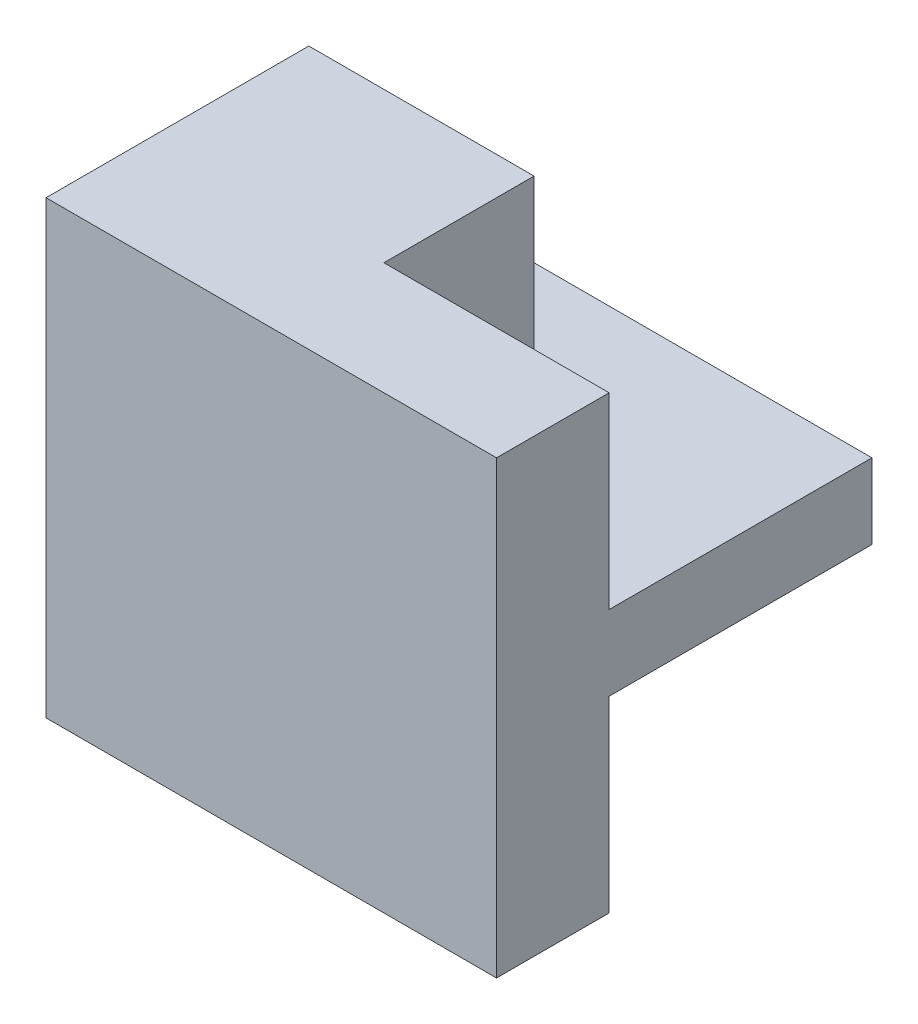
ISO-10303-21;
HEADER;
FILE_DESCRIPTION(('STEP AP214'),'2;1');
FILE_NAME('part.step','',(''),(''),'','','');
FILE_SCHEMA(('AUTOMOTIVE_DESIGN { 1 0 10303 214 1 1 1 1 }'));
ENDSEC;
DATA;
#1=APPLICATION_CONTEXT('core data for automotive mechanical design processes');
#2=APPLICATION_PROTOCOL_DEFINITION('international standard','automotive_design',2000,#1);
#3=PRODUCT_CONTEXT('',#1,'mechanical');
#4=PRODUCT('Part','Part','',(#3));
#5=PRODUCT_RELATED_PRODUCT_CATEGORY('part','',(#4));
#6=PRODUCT_DEFINITION_FORMATION('','',#4);
#7=PRODUCT_DEFINITION_CONTEXT('part definition',#1,'design');
#8=PRODUCT_DEFINITION('design','',#6,#7);
#9=PRODUCT_DEFINITION_SHAPE('','',#8);
#10=(LENGTH_UNIT() NAMED_UNIT(*) SI_UNIT(.MILLI.,.METRE.));
#11=(NAMED_UNIT(*) PLANE_ANGLE_UNIT() SI_UNIT($,.RADIAN.));
#12=(NAMED_UNIT(*) SI_UNIT($,.STERADIAN.) SOLID_ANGLE_UNIT());
#13=UNCERTAINTY_MEASURE_WITH_UNIT(LENGTH_MEASURE(1.E-05),#10,'distance_accuracy_value','');
#14=(GEOMETRIC_REPRESENTATION_CONTEXT(3) GLOBAL_UNCERTAINTY_ASSIGNED_CONTEXT((#13)) GLOBAL_UNIT_ASSIGNED_CONTEXT((#10,
#11,#12)) REPRESENTATION_CONTEXT('',''));
#15=CARTESIAN_POINT('',(0.,0.,0.));
#16=DIRECTION('',(0.,0.,1.));
#17=DIRECTION('',(1.,0.,0.));
#18=AXIS2_PLACEMENT_3D('',#15,#16,#17);
#19=CARTESIAN_POINT('',(-3.,6.,-2.5));
#20=DIRECTION('',(0.,0.,1.));
#21=DIRECTION('',(1.,0.,0.));
#22=AXIS2_PLACEMENT_3D('',#19,#20,#21);
#23=PLANE('',#22);
#24=DIRECTION('',(1.,0.,0.));
#25=VECTOR('',#24,1.);
#26=CARTESIAN_POINT('',(0.,2.5,-2.5));
#27=LINE('',#26,#25);
#28=CARTESIAN_POINT('',(-3.,2.5,-2.5));
#29=VERTEX_POINT('',#28);
#30=CARTESIAN_POINT('',(3.,2.5,-2.5));
#31=VERTEX_POINT('',#30);
#32=EDGE_CURVE('E149',#29,#31,#27,.T.);
#33=ORIENTED_EDGE('',*,*,#32,.F.);
#34=DIRECTION('',(0.,-1.,0.));
#35=VECTOR('',#34,1.);
#36=CARTESIAN_POINT('',(-3.,6.,-2.5));
#37=LINE('',#36,#35);
#38=CARTESIAN_POINT('',(-3.,3.5,-2.5));
#39=VERTEX_POINT('',#38);
#40=EDGE_CURVE('E41',#39,#29,#37,.T.);
#41=ORIENTED_EDGE('',*,*,#40,.F.);
#42=DIRECTION('',(-1.,0.,0.));
#43=VECTOR('',#42,1.);
#44=CARTESIAN_POINT('',(0.,3.5,-2.5));
#45=LINE('',#44,#43);
#46=CARTESIAN_POINT('',(3.,3.5,-2.5));
#47=VERTEX_POINT('',#46);
#48=EDGE_CURVE('E170',#47,#39,#45,.T.);
#49=ORIENTED_EDGE('',*,*,#48,.F.);
#50=DIRECTION('',(0.,-1.,0.));
#51=VECTOR('',#50,1.);
#52=CARTESIAN_POINT('',(3.,6.,-2.5));
#53=LINE('',#52,#51);
#54=EDGE_CURVE('E11',#47,#31,#53,.T.);
#55=ORIENTED_EDGE('',*,*,#54,.T.);
#56=EDGE_LOOP('',(#33,#41,#49,#55));
#57=FACE_BOUND('',#56,.T.);
#58=ADVANCED_FACE('F33',(#57),#23,.F.);
#59=CARTESIAN_POINT('',(3.,6.,2.5));
#60=DIRECTION('',(-1.,0.,0.));
#61=DIRECTION('',(0.,0.,1.));
#62=AXIS2_PLACEMENT_3D('',#59,#60,#61);
#63=PLANE('',#62);
#64=DIRECTION('',(0.,0.,-1.));
#65=VECTOR('',#64,1.);
#66=CARTESIAN_POINT('',(3.,0.,2.5));
#67=LINE('',#66,#65);
#68=CARTESIAN_POINT('',(3.,0.,2.5));
#69=VERTEX_POINT('',#68);
#70=CARTESIAN_POINT('',(3.,0.,1.));
#71=VERTEX_POINT('',#70);
#72=EDGE_CURVE('E184',#69,#71,#67,.T.);
#73=ORIENTED_EDGE('',*,*,#72,.T.);
#74=DIRECTION('',(0.,-1.,0.));
#75=VECTOR('',#74,1.);
#76=CARTESIAN_POINT('',(3.,2.5,1.));
#77=LINE('',#76,#75);
#78=CARTESIAN_POINT('',(3.,2.5,1.));
#79=VERTEX_POINT('',#78);
#80=EDGE_CURVE('E158',#79,#71,#77,.T.);
#81=ORIENTED_EDGE('',*,*,#80,.F.);
#82=DIRECTION('',(0.,0.,1.));
#83=VECTOR('',#82,1.);
#84=CARTESIAN_POINT('',(3.,2.5,0.));
#85=LINE('',#84,#83);
#86=EDGE_CURVE('E151',#31,#79,#85,.T.);
#87=ORIENTED_EDGE('',*,*,#86,.F.);
#88=ORIENTED_EDGE('',*,*,#54,.F.);
#89=DIRECTION('',(0.,0.,-1.));
#90=VECTOR('',#89,1.);
#91=CARTESIAN_POINT('',(3.,3.5,0.));
#92=LINE('',#91,#90);
#93=CARTESIAN_POINT('',(3.,3.5,1.));
#94=VERTEX_POINT('',#93);
#95=EDGE_CURVE('E168',#94,#47,#92,.T.);
#96=ORIENTED_EDGE('',*,*,#95,.F.);
#97=DIRECTION('',(0.,1.,0.));
#98=VECTOR('',#97,1.);
#99=CARTESIAN_POINT('',(3.,3.5,1.));
#100=LINE('',#99,#98);
#101=CARTESIAN_POINT('',(3.,6.,1.));
#102=VERTEX_POINT('',#101);
#103=EDGE_CURVE('E185',#94,#102,#100,.T.);
#104=ORIENTED_EDGE('',*,*,#103,.T.);
#105=DIRECTION('',(0.,0.,-1.));
#106=VECTOR('',#105,1.);
#107=CARTESIAN_POINT('',(3.,6.,2.5));
#108=LINE('',#107,#106);
#109=CARTESIAN_POINT('',(3.,6.,2.5));
#110=VERTEX_POINT('',#109);
#111=EDGE_CURVE('E191',#110,#102,#108,.T.);
#112=ORIENTED_EDGE('',*,*,#111,.F.);
#113=DIRECTION('',(0.,-1.,0.));
#114=VECTOR('',#113,1.);
#115=CARTESIAN_POINT('',(3.,6.,2.5));
#116=LINE('',#115,#114);
#117=EDGE_CURVE('E199',#110,#69,#116,.T.);
#118=ORIENTED_EDGE('',*,*,#117,.T.);
#119=EDGE_LOOP('',(#73,#81,#87,#88,#96,#104,#112,#118));
#120=FACE_BOUND('',#119,.T.);
#121=ADVANCED_FACE('F35',(#120),#63,.F.);
#122=CARTESIAN_POINT('',(-3.,6.,2.5));
#123=DIRECTION('',(1.,0.,0.));
#124=DIRECTION('',(0.,0.,-1.));
#125=AXIS2_PLACEMENT_3D('',#122,#123,#124);
#126=PLANE('',#125);
#127=DIRECTION('',(0.,0.,-1.));
#128=VECTOR('',#127,1.);
#129=CARTESIAN_POINT('',(-3.,2.5,0.));
#130=LINE('',#129,#128);
#131=CARTESIAN_POINT('',(-3.,2.5,-1.));
#132=VERTEX_POINT('',#131);
#133=EDGE_CURVE('E138',#132,#29,#130,.T.);
#134=ORIENTED_EDGE('',*,*,#133,.F.);
#135=DIRECTION('',(0.,-1.,0.));
#136=VECTOR('',#135,1.);
#137=CARTESIAN_POINT('',(-3.,2.5,-1.));
#138=LINE('',#137,#136);
#139=CARTESIAN_POINT('',(-3.,0.,-1.));
#140=VERTEX_POINT('',#139);
#141=EDGE_CURVE('E129',#132,#140,#138,.T.);
#142=ORIENTED_EDGE('',*,*,#141,.T.);
#143=DIRECTION('',(0.,0.,1.));
#144=VECTOR('',#143,1.);
#145=CARTESIAN_POINT('',(-3.,0.,2.5));
#146=LINE('',#145,#144);
#147=CARTESIAN_POINT('',(-3.,0.,2.5));
#148=VERTEX_POINT('',#147);
#149=EDGE_CURVE('E202',#140,#148,#146,.T.);
#150=ORIENTED_EDGE('',*,*,#149,.T.);
#151=DIRECTION('',(0.,-1.,0.));
#152=VECTOR('',#151,1.);
#153=CARTESIAN_POINT('',(-3.,6.,2.5));
#154=LINE('',#153,#152);
#155=CARTESIAN_POINT('',(-3.,6.,2.5));
#156=VERTEX_POINT('',#155);
#157=EDGE_CURVE('E207',#156,#148,#154,.T.);
#158=ORIENTED_EDGE('',*,*,#157,.F.);
#159=DIRECTION('',(0.,0.,1.));
#160=VECTOR('',#159,1.);
#161=CARTESIAN_POINT('',(-3.,6.,2.5));
#162=LINE('',#161,#160);
#163=CARTESIAN_POINT('',(-3.,6.,-1.));
#164=VERTEX_POINT('',#163);
#165=EDGE_CURVE('E194',#164,#156,#162,.T.);
#166=ORIENTED_EDGE('',*,*,#165,.F.);
#167=DIRECTION('',(0.,1.,0.));
#168=VECTOR('',#167,1.);
#169=CARTESIAN_POINT('',(-3.,3.5,-1.));
#170=LINE('',#169,#168);
#171=CARTESIAN_POINT('',(-3.,3.5,-1.));
#172=VERTEX_POINT('',#171);
#173=EDGE_CURVE('E182',#172,#164,#170,.T.);
#174=ORIENTED_EDGE('',*,*,#173,.F.);
#175=DIRECTION('',(0.,0.,1.));
#176=VECTOR('',#175,1.);
#177=CARTESIAN_POINT('',(-3.,3.5,0.));
#178=LINE('',#177,#176);
#179=EDGE_CURVE('E172',#39,#172,#178,.T.);
#180=ORIENTED_EDGE('',*,*,#179,.F.);
#181=ORIENTED_EDGE('',*,*,#40,.T.);
#182=EDGE_LOOP('',(#134,#142,#150,#158,#166,#174,#180,#181));
#183=FACE_BOUND('',#182,.T.);
#184=ADVANCED_FACE('F213',(#183),#126,.F.);
#185=CARTESIAN_POINT('',(0.,6.,0.));
#186=DIRECTION('',(0.,-1.,0.));
#187=DIRECTION('',(0.,0.,-1.));
#188=AXIS2_PLACEMENT_3D('',#185,#186,#187);
#189=PLANE('',#188);
#190=DIRECTION('',(-1.,0.,0.));
#191=VECTOR('',#190,1.);
#192=CARTESIAN_POINT('',(0.,6.,-1.));
#193=LINE('',#192,#191);
#194=CARTESIAN_POINT('',(0.,6.,-1.));
#195=VERTEX_POINT('',#194);
#196=EDGE_CURVE('E56',#195,#164,#193,.T.);
#197=ORIENTED_EDGE('',*,*,#196,.T.);
#198=ORIENTED_EDGE('',*,*,#165,.T.);
#199=DIRECTION('',(1.,0.,0.));
#200=VECTOR('',#199,1.);
#201=CARTESIAN_POINT('',(-3.,6.,2.5));
#202=LINE('',#201,#200);
#203=EDGE_CURVE('E197',#156,#110,#202,.T.);
#204=ORIENTED_EDGE('',*,*,#203,.T.);
#205=ORIENTED_EDGE('',*,*,#111,.T.);
#206=DIRECTION('',(-1.,0.,0.));
#207=VECTOR('',#206,1.);
#208=CARTESIAN_POINT('',(0.,6.,1.));
#209=LINE('',#208,#207);
#210=CARTESIAN_POINT('',(0.,6.,1.));
#211=VERTEX_POINT('',#210);
#212=EDGE_CURVE('E164',#102,#211,#209,.T.);
#213=ORIENTED_EDGE('',*,*,#212,.T.);
#214=DIRECTION('',(0.,0.,-1.));
#215=VECTOR('',#214,1.);
#216=CARTESIAN_POINT('',(0.,6.,0.));
#217=LINE('',#216,#215);
#218=EDGE_CURVE('E177',#211,#195,#217,.T.);
#219=ORIENTED_EDGE('',*,*,#218,.T.);
#220=EDGE_LOOP('',(#197,#198,#204,#205,#213,#219));
#221=FACE_BOUND('',#220,.T.);
#222=ADVANCED_FACE('F239',(#221),#189,.F.);
#223=CARTESIAN_POINT('',(-3.,6.,2.5));
#224=DIRECTION('',(0.,0.,-1.));
#225=DIRECTION('',(-1.,0.,0.));
#226=AXIS2_PLACEMENT_3D('',#223,#224,#225);
#227=PLANE('',#226);
#228=DIRECTION('',(1.,0.,0.));
#229=VECTOR('',#228,1.);
#230=CARTESIAN_POINT('',(-3.,0.,2.5));
#231=LINE('',#230,#229);
#232=EDGE_CURVE('E195',#148,#69,#231,.T.);
#233=ORIENTED_EDGE('',*,*,#232,.T.);
#234=ORIENTED_EDGE('',*,*,#117,.F.);
#235=ORIENTED_EDGE('',*,*,#203,.F.);
#236=ORIENTED_EDGE('',*,*,#157,.T.);
#237=EDGE_LOOP('',(#233,#234,#235,#236));
#238=FACE_BOUND('',#237,.T.);
#239=ADVANCED_FACE('F235',(#238),#227,.F.);
#240=CARTESIAN_POINT('',(0.,0.,0.));
#241=DIRECTION('',(0.,-1.,0.));
#242=DIRECTION('',(0.,0.,-1.));
#243=AXIS2_PLACEMENT_3D('',#240,#241,#242);
#244=PLANE('',#243);
#245=DIRECTION('',(-1.,0.,0.));
#246=VECTOR('',#245,1.);
#247=CARTESIAN_POINT('',(0.,0.,1.));
#248=LINE('',#247,#246);
#249=CARTESIAN_POINT('',(0.,0.,1.));
#250=VERTEX_POINT('',#249);
#251=EDGE_CURVE('E142',#71,#250,#248,.T.);
#252=ORIENTED_EDGE('',*,*,#251,.F.);
#253=ORIENTED_EDGE('',*,*,#72,.F.);
#254=ORIENTED_EDGE('',*,*,#232,.F.);
#255=ORIENTED_EDGE('',*,*,#149,.F.);
#256=DIRECTION('',(-1.,0.,0.));
#257=VECTOR('',#256,1.);
#258=CARTESIAN_POINT('',(0.,0.,-1.));
#259=LINE('',#258,#257);
#260=CARTESIAN_POINT('',(0.,0.,-1.));
#261=VERTEX_POINT('',#260);
#262=EDGE_CURVE('E145',#261,#140,#259,.T.);
#263=ORIENTED_EDGE('',*,*,#262,.F.);
#264=DIRECTION('',(0.,0.,-1.));
#265=VECTOR('',#264,1.);
#266=CARTESIAN_POINT('',(0.,0.,0.));
#267=LINE('',#266,#265);
#268=EDGE_CURVE('E48',#250,#261,#267,.T.);
#269=ORIENTED_EDGE('',*,*,#268,.F.);
#270=EDGE_LOOP('',(#252,#253,#254,#255,#263,#269));
#271=FACE_BOUND('',#270,.T.);
#272=ADVANCED_FACE('F228',(#271),#244,.T.);
#273=CARTESIAN_POINT('',(0.,3.5,-1.));
#274=DIRECTION('',(0.,0.,-1.));
#275=DIRECTION('',(-1.,0.,0.));
#276=AXIS2_PLACEMENT_3D('',#273,#274,#275);
#277=PLANE('',#276);
#278=ORIENTED_EDGE('',*,*,#196,.F.);
#279=DIRECTION('',(0.,1.,0.));
#280=VECTOR('',#279,1.);
#281=CARTESIAN_POINT('',(0.,3.5,-1.));
#282=LINE('',#281,#280);
#283=CARTESIAN_POINT('',(0.,3.5,-1.));
#284=VERTEX_POINT('',#283);
#285=EDGE_CURVE('E175',#284,#195,#282,.T.);
#286=ORIENTED_EDGE('',*,*,#285,.F.);
#287=DIRECTION('',(-1.,0.,0.));
#288=VECTOR('',#287,1.);
#289=CARTESIAN_POINT('',(0.,3.5,-1.));
#290=LINE('',#289,#288);
#291=EDGE_CURVE('E161',#284,#172,#290,.T.);
#292=ORIENTED_EDGE('',*,*,#291,.T.);
#293=ORIENTED_EDGE('',*,*,#173,.T.);
#294=EDGE_LOOP('',(#278,#286,#292,#293));
#295=FACE_BOUND('',#294,.T.);
#296=ADVANCED_FACE('F240',(#295),#277,.T.);
#297=CARTESIAN_POINT('',(0.,3.5,1.));
#298=DIRECTION('',(0.,0.,-1.));
#299=DIRECTION('',(-1.,0.,0.));
#300=AXIS2_PLACEMENT_3D('',#297,#298,#299);
#301=PLANE('',#300);
#302=ORIENTED_EDGE('',*,*,#212,.F.);
#303=ORIENTED_EDGE('',*,*,#103,.F.);
#304=DIRECTION('',(-1.,0.,0.));
#305=VECTOR('',#304,1.);
#306=CARTESIAN_POINT('',(0.,3.5,1.));
#307=LINE('',#306,#305);
#308=CARTESIAN_POINT('',(0.,3.5,1.));
#309=VERTEX_POINT('',#308);
#310=EDGE_CURVE('E166',#94,#309,#307,.T.);
#311=ORIENTED_EDGE('',*,*,#310,.T.);
#312=DIRECTION('',(0.,1.,0.));
#313=VECTOR('',#312,1.);
#314=CARTESIAN_POINT('',(0.,3.5,1.));
#315=LINE('',#314,#313);
#316=EDGE_CURVE('E188',#309,#211,#315,.T.);
#317=ORIENTED_EDGE('',*,*,#316,.T.);
#318=EDGE_LOOP('',(#302,#303,#311,#317));
#319=FACE_BOUND('',#318,.T.);
#320=ADVANCED_FACE('F247',(#319),#301,.T.);
#321=CARTESIAN_POINT('',(0.,3.5,0.));
#322=DIRECTION('',(1.,0.,0.));
#323=DIRECTION('',(0.,0.,-1.));
#324=AXIS2_PLACEMENT_3D('',#321,#322,#323);
#325=PLANE('',#324);
#326=ORIENTED_EDGE('',*,*,#218,.F.);
#327=ORIENTED_EDGE('',*,*,#316,.F.);
#328=DIRECTION('',(0.,0.,-1.));
#329=VECTOR('',#328,1.);
#330=CARTESIAN_POINT('',(0.,3.5,0.));
#331=LINE('',#330,#329);
#332=EDGE_CURVE('E163',#309,#284,#331,.T.);
#333=ORIENTED_EDGE('',*,*,#332,.T.);
#334=ORIENTED_EDGE('',*,*,#285,.T.);
#335=EDGE_LOOP('',(#326,#327,#333,#334));
#336=FACE_BOUND('',#335,.T.);
#337=ADVANCED_FACE('F251',(#336),#325,.T.);
#338=CARTESIAN_POINT('',(0.,3.5,0.));
#339=DIRECTION('',(0.,1.,0.));
#340=DIRECTION('',(0.,0.,1.));
#341=AXIS2_PLACEMENT_3D('',#338,#339,#340);
#342=PLANE('',#341);
#343=ORIENTED_EDGE('',*,*,#291,.F.);
#344=ORIENTED_EDGE('',*,*,#332,.F.);
#345=ORIENTED_EDGE('',*,*,#310,.F.);
#346=ORIENTED_EDGE('',*,*,#95,.T.);
#347=ORIENTED_EDGE('',*,*,#48,.T.);
#348=ORIENTED_EDGE('',*,*,#179,.T.);
#349=EDGE_LOOP('',(#343,#344,#345,#346,#347,#348));
#350=FACE_BOUND('',#349,.T.);
#351=ADVANCED_FACE('F244',(#350),#342,.T.);
#352=CARTESIAN_POINT('',(0.,2.5,0.));
#353=DIRECTION('',(-1.,0.,0.));
#354=DIRECTION('',(0.,0.,1.));
#355=AXIS2_PLACEMENT_3D('',#352,#353,#354);
#356=PLANE('',#355);
#357=ORIENTED_EDGE('',*,*,#268,.T.);
#358=DIRECTION('',(0.,-1.,0.));
#359=VECTOR('',#358,1.);
#360=CARTESIAN_POINT('',(0.,2.5,-1.));
#361=LINE('',#360,#359);
#362=CARTESIAN_POINT('',(0.,2.5,-1.));
#363=VERTEX_POINT('',#362);
#364=EDGE_CURVE('E121',#363,#261,#361,.T.);
#365=ORIENTED_EDGE('',*,*,#364,.F.);
#366=DIRECTION('',(0.,0.,-1.));
#367=VECTOR('',#366,1.);
#368=CARTESIAN_POINT('',(0.,2.5,0.));
#369=LINE('',#368,#367);
#370=CARTESIAN_POINT('',(0.,2.5,1.));
#371=VERTEX_POINT('',#370);
#372=EDGE_CURVE('E125',#371,#363,#369,.T.);
#373=ORIENTED_EDGE('',*,*,#372,.F.);
#374=DIRECTION('',(0.,-1.,0.));
#375=VECTOR('',#374,1.);
#376=CARTESIAN_POINT('',(0.,2.5,1.));
#377=LINE('',#376,#375);
#378=EDGE_CURVE('E156',#371,#250,#377,.T.);
#379=ORIENTED_EDGE('',*,*,#378,.T.);
#380=EDGE_LOOP('',(#357,#365,#373,#379));
#381=FACE_BOUND('',#380,.T.);
#382=ADVANCED_FACE('F123',(#381),#356,.F.);
#383=CARTESIAN_POINT('',(0.,2.5,1.));
#384=DIRECTION('',(0.,0.,1.));
#385=DIRECTION('',(1.,0.,0.));
#386=AXIS2_PLACEMENT_3D('',#383,#384,#385);
#387=PLANE('',#386);
#388=ORIENTED_EDGE('',*,*,#251,.T.);
#389=ORIENTED_EDGE('',*,*,#378,.F.);
#390=DIRECTION('',(-1.,0.,0.));
#391=VECTOR('',#390,1.);
#392=CARTESIAN_POINT('',(0.,2.5,1.));
#393=LINE('',#392,#391);
#394=EDGE_CURVE('E130',#79,#371,#393,.T.);
#395=ORIENTED_EDGE('',*,*,#394,.F.);
#396=ORIENTED_EDGE('',*,*,#80,.T.);
#397=EDGE_LOOP('',(#388,#389,#395,#396));
#398=FACE_BOUND('',#397,.T.);
#399=ADVANCED_FACE('F226',(#398),#387,.F.);
#400=CARTESIAN_POINT('',(0.,2.5,-1.));
#401=DIRECTION('',(0.,0.,1.));
#402=DIRECTION('',(1.,0.,0.));
#403=AXIS2_PLACEMENT_3D('',#400,#401,#402);
#404=PLANE('',#403);
#405=ORIENTED_EDGE('',*,*,#262,.T.);
#406=ORIENTED_EDGE('',*,*,#141,.F.);
#407=DIRECTION('',(-1.,0.,0.));
#408=VECTOR('',#407,1.);
#409=CARTESIAN_POINT('',(0.,2.5,-1.));
#410=LINE('',#409,#408);
#411=EDGE_CURVE('E133',#363,#132,#410,.T.);
#412=ORIENTED_EDGE('',*,*,#411,.F.);
#413=ORIENTED_EDGE('',*,*,#364,.T.);
#414=EDGE_LOOP('',(#405,#406,#412,#413));
#415=FACE_BOUND('',#414,.T.);
#416=ADVANCED_FACE('F134',(#415),#404,.F.);
#417=CARTESIAN_POINT('',(0.,2.5,0.));
#418=DIRECTION('',(0.,-1.,0.));
#419=DIRECTION('',(0.,0.,-1.));
#420=AXIS2_PLACEMENT_3D('',#417,#418,#419);
#421=PLANE('',#420);
#422=ORIENTED_EDGE('',*,*,#372,.T.);
#423=ORIENTED_EDGE('',*,*,#411,.T.);
#424=ORIENTED_EDGE('',*,*,#133,.T.);
#425=ORIENTED_EDGE('',*,*,#32,.T.);
#426=ORIENTED_EDGE('',*,*,#86,.T.);
#427=ORIENTED_EDGE('',*,*,#394,.T.);
#428=EDGE_LOOP('',(#422,#423,#424,#425,#426,#427));
#429=FACE_BOUND('',#428,.T.);
#430=ADVANCED_FACE('F140',(#429),#421,.T.);
#431=CLOSED_SHELL('',(#58,#121,#184,#222,#239,#272,#296,#320,#337,#351,#382,#399,#416,#430));
#432=MANIFOLD_SOLID_BREP('B2',#431);
#433=ADVANCED_BREP_SHAPE_REPRESENTATION('',(#18,#432),#14);
#434=SHAPE_DEFINITION_REPRESENTATION(#9,#433);
ENDSEC;
END-ISO-10303-21;
